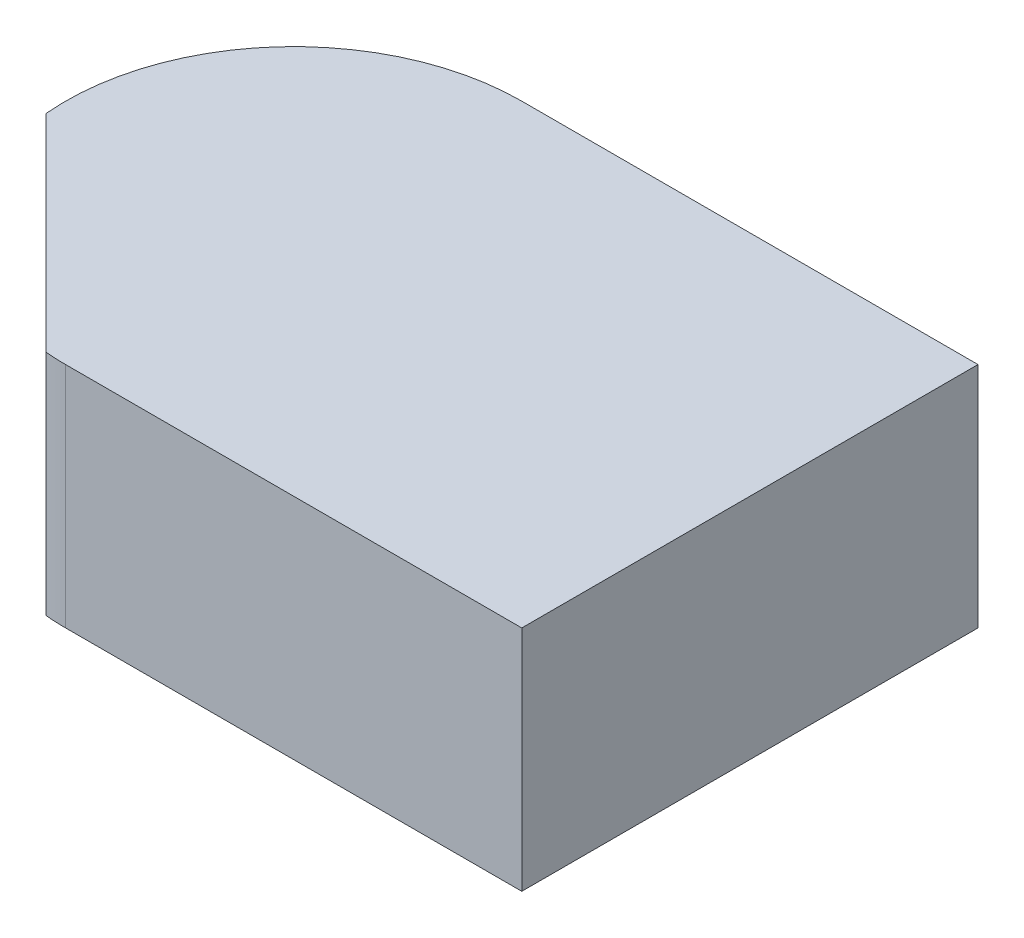
ISO-10303-21;
HEADER;
FILE_DESCRIPTION(('STEP AP214'),'2;1');
FILE_NAME('part.step','',(''),(''),'','','');
FILE_SCHEMA(('AUTOMOTIVE_DESIGN { 1 0 10303 214 1 1 1 1 }'));
ENDSEC;
DATA;
#1=APPLICATION_CONTEXT('core data for automotive mechanical design processes');
#2=APPLICATION_PROTOCOL_DEFINITION('international standard','automotive_design',2000,#1);
#3=PRODUCT_CONTEXT('',#1,'mechanical');
#4=PRODUCT('Part','Part','',(#3));
#5=PRODUCT_RELATED_PRODUCT_CATEGORY('part','',(#4));
#6=PRODUCT_DEFINITION_FORMATION('','',#4);
#7=PRODUCT_DEFINITION_CONTEXT('part definition',#1,'design');
#8=PRODUCT_DEFINITION('design','',#6,#7);
#9=PRODUCT_DEFINITION_SHAPE('','',#8);
#10=(LENGTH_UNIT() NAMED_UNIT(*) SI_UNIT(.MILLI.,.METRE.));
#11=(NAMED_UNIT(*) PLANE_ANGLE_UNIT() SI_UNIT($,.RADIAN.));
#12=(NAMED_UNIT(*) SI_UNIT($,.STERADIAN.) SOLID_ANGLE_UNIT());
#13=UNCERTAINTY_MEASURE_WITH_UNIT(LENGTH_MEASURE(1.E-05),#10,'distance_accuracy_value','');
#14=(GEOMETRIC_REPRESENTATION_CONTEXT(3) GLOBAL_UNCERTAINTY_ASSIGNED_CONTEXT((#13)) GLOBAL_UNIT_ASSIGNED_CONTEXT((#10,
#11,#12)) REPRESENTATION_CONTEXT('',''));
#15=CARTESIAN_POINT('',(0.,0.,0.));
#16=DIRECTION('',(0.,0.,1.));
#17=DIRECTION('',(1.,0.,0.));
#18=AXIS2_PLACEMENT_3D('',#15,#16,#17);
#19=CARTESIAN_POINT('',(0.,0.,0.));
#20=DIRECTION('',(0.,1.,0.));
#21=DIRECTION('',(1.,0.,0.));
#22=AXIS2_PLACEMENT_3D('',#19,#20,#21);
#23=PLANE('',#22);
#24=CARTESIAN_POINT('',(1.05,0.,1.8));
#25=DIRECTION('',(0.,1.,0.));
#26=DIRECTION('',(0.,0.,-1.));
#27=AXIS2_PLACEMENT_3D('',#24,#25,#26);
#28=CIRCLE('',#27,0.1);
#29=CARTESIAN_POINT('',(1.05,0.,1.7));
#30=VERTEX_POINT('',#29);
#31=CARTESIAN_POINT('',(0.950404281995,0.,1.808982925758));
#32=VERTEX_POINT('',#31);
#33=EDGE_CURVE('E11',#30,#32,#28,.T.);
#34=ORIENTED_EDGE('',*,*,#33,.F.);
#35=DIRECTION('',(-1.,0.,0.));
#36=VECTOR('',#35,1.);
#37=CARTESIAN_POINT('',(1.25,0.,1.7));
#38=LINE('',#37,#36);
#39=CARTESIAN_POINT('',(1.25,0.,1.7));
#40=VERTEX_POINT('',#39);
#41=EDGE_CURVE('E25',#40,#30,#38,.T.);
#42=ORIENTED_EDGE('',*,*,#41,.F.);
#43=DIRECTION('',(0.,0.,-1.));
#44=VECTOR('',#43,1.);
#45=CARTESIAN_POINT('',(1.25,0.,1.9));
#46=LINE('',#45,#44);
#47=CARTESIAN_POINT('',(1.25,0.,1.9));
#48=VERTEX_POINT('',#47);
#49=EDGE_CURVE('E146',#48,#40,#46,.T.);
#50=ORIENTED_EDGE('',*,*,#49,.F.);
#51=DIRECTION('',(1.,0.,0.));
#52=VECTOR('',#51,1.);
#53=CARTESIAN_POINT('',(1.05,0.,1.9));
#54=LINE('',#53,#52);
#55=CARTESIAN_POINT('',(1.05,0.,1.9));
#56=VERTEX_POINT('',#55);
#57=EDGE_CURVE('E142',#56,#48,#54,.T.);
#58=ORIENTED_EDGE('',*,*,#57,.F.);
#59=CARTESIAN_POINT('',(1.05,0.,1.8));
#60=DIRECTION('',(0.,1.,0.));
#61=DIRECTION('',(-0.0898292575823554,0.,0.995957180044505));
#62=AXIS2_PLACEMENT_3D('',#59,#60,#61);
#63=CIRCLE('',#62,0.1);
#64=CARTESIAN_POINT('',(1.041017074242,0.,1.899595718004));
#65=VERTEX_POINT('',#64);
#66=EDGE_CURVE('E89',#65,#56,#63,.T.);
#67=ORIENTED_EDGE('',*,*,#66,.F.);
#68=DIRECTION('',(0.707106781186548,0.,0.707106781186548));
#69=VECTOR('',#68,1.);
#70=CARTESIAN_POINT('',(0.950404281995,0.,1.808982925758));
#71=LINE('',#70,#69);
#72=EDGE_CURVE('E134',#32,#65,#71,.T.);
#73=ORIENTED_EDGE('',*,*,#72,.F.);
#74=EDGE_LOOP('',(#34,#42,#50,#58,#67,#73));
#75=FACE_BOUND('',#74,.T.);
#76=ADVANCED_FACE('F17',(#75),#23,.F.);
#77=CARTESIAN_POINT('',(0.950404281995,-0.02,1.808982925758));
#78=DIRECTION('',(-0.707106781186548,0.,0.707106781186548));
#79=DIRECTION('',(0.707106781186548,0.,0.707106781186548));
#80=AXIS2_PLACEMENT_3D('',#77,#78,#79);
#81=PLANE('',#80);
#82=DIRECTION('',(0.,1.,0.));
#83=VECTOR('',#82,1.);
#84=CARTESIAN_POINT('',(1.041017074242,0.,1.899595718004));
#85=LINE('',#84,#83);
#86=CARTESIAN_POINT('',(1.041017074242,0.1,1.899595718004));
#87=VERTEX_POINT('',#86);
#88=EDGE_CURVE('E130',#65,#87,#85,.T.);
#89=ORIENTED_EDGE('',*,*,#88,.T.);
#90=DIRECTION('',(0.707106781186548,0.,0.707106781186548));
#91=VECTOR('',#90,1.);
#92=CARTESIAN_POINT('',(0.950404281995,0.1,1.808982925758));
#93=LINE('',#92,#91);
#94=CARTESIAN_POINT('',(0.950404281995,0.1,1.808982925758));
#95=VERTEX_POINT('',#94);
#96=EDGE_CURVE('E84',#95,#87,#93,.T.);
#97=ORIENTED_EDGE('',*,*,#96,.F.);
#98=DIRECTION('',(0.,1.,0.));
#99=VECTOR('',#98,1.);
#100=CARTESIAN_POINT('',(0.950404281995,0.,1.808982925758));
#101=LINE('',#100,#99);
#102=EDGE_CURVE('E122',#32,#95,#101,.T.);
#103=ORIENTED_EDGE('',*,*,#102,.F.);
#104=ORIENTED_EDGE('',*,*,#72,.T.);
#105=EDGE_LOOP('',(#89,#97,#103,#104));
#106=FACE_BOUND('',#105,.T.);
#107=ADVANCED_FACE('F161',(#106),#81,.T.);
#108=CARTESIAN_POINT('',(1.05,0.,1.8));
#109=DIRECTION('',(0.,1.,0.));
#110=DIRECTION('',(0.738183330067649,0.,0.674600156544777));
#111=AXIS2_PLACEMENT_3D('',#108,#109,#110);
#112=CYLINDRICAL_SURFACE('',#111,0.1);
#113=CARTESIAN_POINT('',(1.05,0.1,1.8));
#114=DIRECTION('',(0.,1.,0.));
#115=DIRECTION('',(0.,0.,-1.));
#116=AXIS2_PLACEMENT_3D('',#113,#114,#115);
#117=CIRCLE('',#116,0.1);
#118=CARTESIAN_POINT('',(1.05,0.1,1.7));
#119=VERTEX_POINT('',#118);
#120=EDGE_CURVE('E118',#119,#95,#117,.T.);
#121=ORIENTED_EDGE('',*,*,#120,.F.);
#122=DIRECTION('',(0.,1.,0.));
#123=VECTOR('',#122,1.);
#124=CARTESIAN_POINT('',(1.05,0.,1.7));
#125=LINE('',#124,#123);
#126=EDGE_CURVE('E113',#30,#119,#125,.T.);
#127=ORIENTED_EDGE('',*,*,#126,.F.);
#128=ORIENTED_EDGE('',*,*,#33,.T.);
#129=ORIENTED_EDGE('',*,*,#102,.T.);
#130=EDGE_LOOP('',(#121,#127,#128,#129));
#131=FACE_BOUND('',#130,.T.);
#132=ADVANCED_FACE('F163',(#131),#112,.T.);
#133=CARTESIAN_POINT('',(1.25,0.,1.7));
#134=DIRECTION('',(0.,0.,-1.));
#135=DIRECTION('',(-1.,0.,0.));
#136=AXIS2_PLACEMENT_3D('',#133,#134,#135);
#137=PLANE('',#136);
#138=ORIENTED_EDGE('',*,*,#126,.T.);
#139=DIRECTION('',(-1.,0.,0.));
#140=VECTOR('',#139,1.);
#141=CARTESIAN_POINT('',(1.25,0.1,1.7));
#142=LINE('',#141,#140);
#143=CARTESIAN_POINT('',(1.25,0.1,1.7));
#144=VERTEX_POINT('',#143);
#145=EDGE_CURVE('E108',#144,#119,#142,.T.);
#146=ORIENTED_EDGE('',*,*,#145,.F.);
#147=DIRECTION('',(0.,1.,0.));
#148=VECTOR('',#147,1.);
#149=CARTESIAN_POINT('',(1.25,0.,1.7));
#150=LINE('',#149,#148);
#151=EDGE_CURVE('E103',#40,#144,#150,.T.);
#152=ORIENTED_EDGE('',*,*,#151,.F.);
#153=ORIENTED_EDGE('',*,*,#41,.T.);
#154=EDGE_LOOP('',(#138,#146,#152,#153));
#155=FACE_BOUND('',#154,.T.);
#156=ADVANCED_FACE('F156',(#155),#137,.T.);
#157=CARTESIAN_POINT('',(1.25,0.,1.9));
#158=DIRECTION('',(1.,0.,0.));
#159=DIRECTION('',(0.,0.,-1.));
#160=AXIS2_PLACEMENT_3D('',#157,#158,#159);
#161=PLANE('',#160);
#162=ORIENTED_EDGE('',*,*,#151,.T.);
#163=DIRECTION('',(0.,0.,-1.));
#164=VECTOR('',#163,1.);
#165=CARTESIAN_POINT('',(1.25,0.1,1.9));
#166=LINE('',#165,#164);
#167=CARTESIAN_POINT('',(1.25,0.1,1.9));
#168=VERTEX_POINT('',#167);
#169=EDGE_CURVE('E99',#168,#144,#166,.T.);
#170=ORIENTED_EDGE('',*,*,#169,.F.);
#171=DIRECTION('',(0.,1.,0.));
#172=VECTOR('',#171,1.);
#173=CARTESIAN_POINT('',(1.25,0.,1.9));
#174=LINE('',#173,#172);
#175=EDGE_CURVE('E75',#48,#168,#174,.T.);
#176=ORIENTED_EDGE('',*,*,#175,.F.);
#177=ORIENTED_EDGE('',*,*,#49,.T.);
#178=EDGE_LOOP('',(#162,#170,#176,#177));
#179=FACE_BOUND('',#178,.T.);
#180=ADVANCED_FACE('F158',(#179),#161,.T.);
#181=CARTESIAN_POINT('',(1.05,0.,1.9));
#182=DIRECTION('',(0.,0.,1.));
#183=DIRECTION('',(1.,0.,0.));
#184=AXIS2_PLACEMENT_3D('',#181,#182,#183);
#185=PLANE('',#184);
#186=ORIENTED_EDGE('',*,*,#175,.T.);
#187=DIRECTION('',(1.,0.,0.));
#188=VECTOR('',#187,1.);
#189=CARTESIAN_POINT('',(1.05,0.1,1.9));
#190=LINE('',#189,#188);
#191=CARTESIAN_POINT('',(1.05,0.1,1.9));
#192=VERTEX_POINT('',#191);
#193=EDGE_CURVE('E67',#192,#168,#190,.T.);
#194=ORIENTED_EDGE('',*,*,#193,.F.);
#195=DIRECTION('',(0.,1.,0.));
#196=VECTOR('',#195,1.);
#197=CARTESIAN_POINT('',(1.05,0.,1.9));
#198=LINE('',#197,#196);
#199=EDGE_CURVE('E72',#56,#192,#198,.T.);
#200=ORIENTED_EDGE('',*,*,#199,.F.);
#201=ORIENTED_EDGE('',*,*,#57,.T.);
#202=EDGE_LOOP('',(#186,#194,#200,#201));
#203=FACE_BOUND('',#202,.T.);
#204=ADVANCED_FACE('F69',(#203),#185,.T.);
#205=CARTESIAN_POINT('',(1.05,0.,1.8));
#206=DIRECTION('',(0.,1.,0.));
#207=DIRECTION('',(0.0449600931688023,0.,-0.998988783731956));
#208=AXIS2_PLACEMENT_3D('',#205,#206,#207);
#209=CYLINDRICAL_SURFACE('',#208,0.1);
#210=ORIENTED_EDGE('',*,*,#66,.T.);
#211=ORIENTED_EDGE('',*,*,#199,.T.);
#212=CARTESIAN_POINT('',(1.05,0.1,1.8));
#213=DIRECTION('',(0.,1.,0.));
#214=DIRECTION('',(-0.0898292575823554,0.,0.995957180044505));
#215=AXIS2_PLACEMENT_3D('',#212,#213,#214);
#216=CIRCLE('',#215,0.1);
#217=EDGE_CURVE('E81',#87,#192,#216,.T.);
#218=ORIENTED_EDGE('',*,*,#217,.F.);
#219=ORIENTED_EDGE('',*,*,#88,.F.);
#220=EDGE_LOOP('',(#210,#211,#218,#219));
#221=FACE_BOUND('',#220,.T.);
#222=ADVANCED_FACE('F88',(#221),#209,.T.);
#223=CARTESIAN_POINT('',(0.,0.1,0.));
#224=DIRECTION('',(0.,1.,0.));
#225=DIRECTION('',(1.,0.,0.));
#226=AXIS2_PLACEMENT_3D('',#223,#224,#225);
#227=PLANE('',#226);
#228=ORIENTED_EDGE('',*,*,#217,.T.);
#229=ORIENTED_EDGE('',*,*,#193,.T.);
#230=ORIENTED_EDGE('',*,*,#169,.T.);
#231=ORIENTED_EDGE('',*,*,#145,.T.);
#232=ORIENTED_EDGE('',*,*,#120,.T.);
#233=ORIENTED_EDGE('',*,*,#96,.T.);
#234=EDGE_LOOP('',(#228,#229,#230,#231,#232,#233));
#235=FACE_BOUND('',#234,.T.);
#236=ADVANCED_FACE('F82',(#235),#227,.T.);
#237=CLOSED_SHELL('',(#76,#107,#132,#156,#180,#204,#222,#236));
#238=MANIFOLD_SOLID_BREP('B1',#237);
#239=ADVANCED_BREP_SHAPE_REPRESENTATION('',(#18,#238),#14);
#240=SHAPE_DEFINITION_REPRESENTATION(#9,#239);
ENDSEC;
END-ISO-10303-21;
